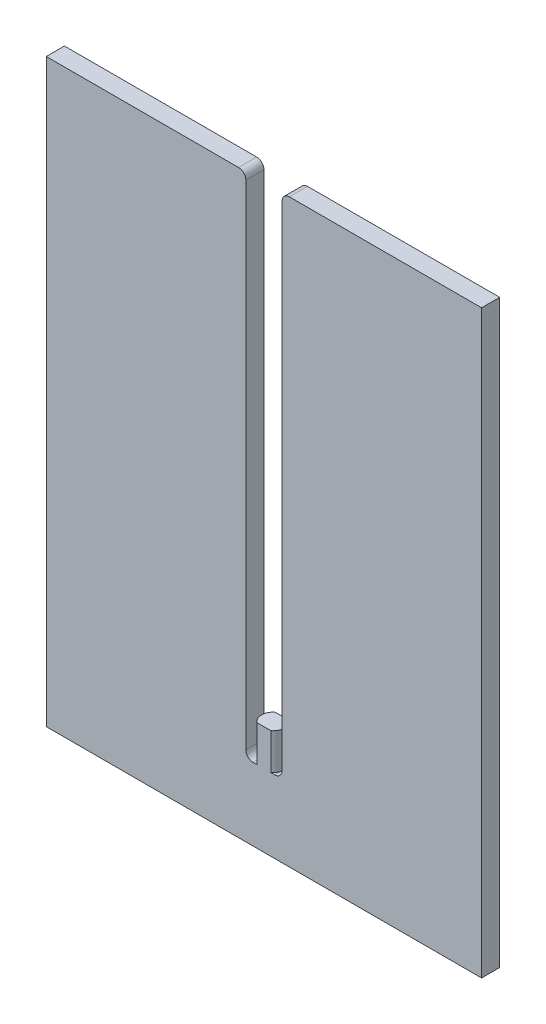
ISO-10303-21;
HEADER;
FILE_DESCRIPTION(('STEP AP214'),'2;1');
FILE_NAME('part.step','',(''),(''),'','','');
FILE_SCHEMA(('AUTOMOTIVE_DESIGN { 1 0 10303 214 1 1 1 1 }'));
ENDSEC;
DATA;
#1=APPLICATION_CONTEXT('core data for automotive mechanical design processes');
#2=APPLICATION_PROTOCOL_DEFINITION('international standard','automotive_design',2000,#1);
#3=PRODUCT_CONTEXT('',#1,'mechanical');
#4=PRODUCT('Part','Part','',(#3));
#5=PRODUCT_RELATED_PRODUCT_CATEGORY('part','',(#4));
#6=PRODUCT_DEFINITION_FORMATION('','',#4);
#7=PRODUCT_DEFINITION_CONTEXT('part definition',#1,'design');
#8=PRODUCT_DEFINITION('design','',#6,#7);
#9=PRODUCT_DEFINITION_SHAPE('','',#8);
#10=(LENGTH_UNIT() NAMED_UNIT(*) SI_UNIT(.MILLI.,.METRE.));
#11=(NAMED_UNIT(*) PLANE_ANGLE_UNIT() SI_UNIT($,.RADIAN.));
#12=(NAMED_UNIT(*) SI_UNIT($,.STERADIAN.) SOLID_ANGLE_UNIT());
#13=UNCERTAINTY_MEASURE_WITH_UNIT(LENGTH_MEASURE(1.E-05),#10,'distance_accuracy_value','');
#14=(GEOMETRIC_REPRESENTATION_CONTEXT(3) GLOBAL_UNCERTAINTY_ASSIGNED_CONTEXT((#13)) GLOBAL_UNIT_ASSIGNED_CONTEXT((#10,
#11,#12)) REPRESENTATION_CONTEXT('',''));
#15=CARTESIAN_POINT('',(0.,0.,0.));
#16=DIRECTION('',(0.,0.,1.));
#17=DIRECTION('',(1.,0.,0.));
#18=AXIS2_PLACEMENT_3D('',#15,#16,#17);
#19=CARTESIAN_POINT('',(-2.49999999999999,-30.,2.5));
#20=DIRECTION('',(0.,-1.,0.));
#21=DIRECTION('',(0.,0.,-1.));
#22=AXIS2_PLACEMENT_3D('',#19,#20,#21);
#23=PLANE('',#22);
#24=CARTESIAN_POINT('',(0.,-30.,1.25));
#25=DIRECTION('',(0.,1.,0.));
#26=DIRECTION('',(0.,0.,1.));
#27=AXIS2_PLACEMENT_3D('',#24,#25,#26);
#28=CIRCLE('',#27,1.5748);
#29=CARTESIAN_POINT('',(-0.957859613930977,-30.,0.));
#30=VERTEX_POINT('',#29);
#31=CARTESIAN_POINT('',(-1.49999999999999,-30.,0.77042201885405));
#32=VERTEX_POINT('',#31);
#33=EDGE_CURVE('E224',#30,#32,#28,.T.);
#34=ORIENTED_EDGE('',*,*,#33,.F.);
#35=DIRECTION('',(-1.,0.,0.));
#36=VECTOR('',#35,1.);
#37=CARTESIAN_POINT('',(-2.49999999999999,-30.,0.));
#38=LINE('',#37,#36);
#39=CARTESIAN_POINT('',(-1.49999999999999,-30.,0.));
#40=VERTEX_POINT('',#39);
#41=EDGE_CURVE('E252',#30,#40,#38,.T.);
#42=ORIENTED_EDGE('',*,*,#41,.T.);
#43=DIRECTION('',(0.,0.,-1.));
#44=VECTOR('',#43,1.);
#45=CARTESIAN_POINT('',(-1.49999999999999,-30.,2.5));
#46=LINE('',#45,#44);
#47=EDGE_CURVE('E374',#40,#32,#46,.F.);
#48=ORIENTED_EDGE('',*,*,#47,.T.);
#49=EDGE_LOOP('',(#34,#42,#48));
#50=FACE_BOUND('',#49,.T.);
#51=ADVANCED_FACE('F33',(#50),#23,.F.);
#52=CARTESIAN_POINT('',(-1.49999999999999,-30.,1.72957798114595));
#53=VERTEX_POINT('',#52);
#54=CARTESIAN_POINT('',(-0.957859613930977,-30.,2.5));
#55=VERTEX_POINT('',#54);
#56=EDGE_CURVE('E185',#53,#55,#28,.T.);
#57=ORIENTED_EDGE('',*,*,#56,.F.);
#58=CARTESIAN_POINT('',(-1.49999999999999,-30.,2.5));
#59=VERTEX_POINT('',#58);
#60=EDGE_CURVE('E37',#53,#59,#46,.F.);
#61=ORIENTED_EDGE('',*,*,#60,.T.);
#62=DIRECTION('',(-1.,0.,0.));
#63=VECTOR('',#62,1.);
#64=CARTESIAN_POINT('',(-2.49999999999999,-30.,2.5));
#65=LINE('',#64,#63);
#66=EDGE_CURVE('E50',#55,#59,#65,.T.);
#67=ORIENTED_EDGE('',*,*,#66,.F.);
#68=EDGE_LOOP('',(#57,#61,#67));
#69=FACE_BOUND('',#68,.T.);
#70=ADVANCED_FACE('F331',(#69),#23,.F.);
#71=CARTESIAN_POINT('',(0.,-30.,1.25));
#72=DIRECTION('',(0.,1.,0.));
#73=DIRECTION('',(0.,0.,1.));
#74=AXIS2_PLACEMENT_3D('',#71,#72,#73);
#75=CIRCLE('',#74,1.5748);
#76=CARTESIAN_POINT('',(0.957859613930977,-30.,2.5));
#77=VERTEX_POINT('',#76);
#78=CARTESIAN_POINT('',(1.49999999999999,-30.,1.72957798114595));
#79=VERTEX_POINT('',#78);
#80=EDGE_CURVE('E58',#77,#79,#75,.T.);
#81=ORIENTED_EDGE('',*,*,#80,.F.);
#82=CARTESIAN_POINT('',(1.49999999999999,-30.,2.5));
#83=VERTEX_POINT('',#82);
#84=EDGE_CURVE('E395',#83,#77,#65,.T.);
#85=ORIENTED_EDGE('',*,*,#84,.F.);
#86=DIRECTION('',(0.,0.,-1.));
#87=VECTOR('',#86,1.);
#88=CARTESIAN_POINT('',(1.49999999999999,-30.,0.));
#89=LINE('',#88,#87);
#90=EDGE_CURVE('E300',#83,#79,#89,.T.);
#91=ORIENTED_EDGE('',*,*,#90,.T.);
#92=EDGE_LOOP('',(#81,#85,#91));
#93=FACE_BOUND('',#92,.T.);
#94=ADVANCED_FACE('F337',(#93),#23,.F.);
#95=CARTESIAN_POINT('',(1.49999999999999,-30.,0.77042201885405));
#96=VERTEX_POINT('',#95);
#97=CARTESIAN_POINT('',(0.957859613930977,-30.,0.));
#98=VERTEX_POINT('',#97);
#99=EDGE_CURVE('E232',#96,#98,#75,.T.);
#100=ORIENTED_EDGE('',*,*,#99,.F.);
#101=CARTESIAN_POINT('',(1.49999999999999,-30.,0.));
#102=VERTEX_POINT('',#101);
#103=EDGE_CURVE('E292',#96,#102,#89,.T.);
#104=ORIENTED_EDGE('',*,*,#103,.T.);
#105=EDGE_CURVE('E249',#102,#98,#38,.T.);
#106=ORIENTED_EDGE('',*,*,#105,.T.);
#107=EDGE_LOOP('',(#100,#104,#106));
#108=FACE_BOUND('',#107,.T.);
#109=ADVANCED_FACE('F333',(#108),#23,.F.);
#110=CARTESIAN_POINT('',(-1.49999999999999,-29.,2.5));
#111=DIRECTION('',(0.,0.,1.));
#112=DIRECTION('',(1.,0.,0.));
#113=AXIS2_PLACEMENT_3D('',#110,#111,#112);
#114=CYLINDRICAL_SURFACE('',#113,1.);
#115=CARTESIAN_POINT('',(-1.49999999999999,-30.,0.770422018854051));
#116=CARTESIAN_POINT('',(-1.50823685902977,-30.000000801367,0.79618266378926));
#117=CARTESIAN_POINT('',(-1.51580883205124,-29.9999744613474,0.822155822113716));
#118=CARTESIAN_POINT('',(-1.52960575146465,-29.999869903012,0.874457487366343));
#119=CARTESIAN_POINT('',(-1.53583069289908,-29.9997916845052,0.900785995601939));
#120=CARTESIAN_POINT('',(-1.54691627444093,-29.9995857729442,0.953728686704265));
#121=CARTESIAN_POINT('',(-1.55177690450608,-29.9994580795257,0.980342871672275));
#122=CARTESIAN_POINT('',(-1.56012117086977,-29.9991411996913,1.0337862314104));
#123=CARTESIAN_POINT('',(-1.56360479196491,-29.9989520125964,1.06061540855089));
#124=CARTESIAN_POINT('',(-1.56918575178574,-29.998557817331,1.11441756391079));
#125=CARTESIAN_POINT('',(-1.57128307010401,-29.9983528089276,1.14139054424119));
#126=CARTESIAN_POINT('',(-1.57408585601794,-29.9977562993795,1.19540872479852));
#127=CARTESIAN_POINT('',(-1.57479129800291,-29.9973647948035,1.22245392634515));
#128=CARTESIAN_POINT('',(-1.57480485665639,-29.9971033924785,1.26498255657344));
#129=CARTESIAN_POINT('',(-1.57458140054261,-29.9970820589953,1.28046604249277));
#130=CARTESIAN_POINT('',(-1.5737766149523,-29.9971369409621,1.30804040607153));
#131=CARTESIAN_POINT('',(-1.57328406517811,-29.9971928767355,1.32013397327205));
#132=CARTESIAN_POINT('',(-1.57186848695075,-29.9973345325519,1.34721008661226));
#133=CARTESIAN_POINT('',(-1.57087047068141,-29.9974241795792,1.36218873907546));
#134=CARTESIAN_POINT('',(-1.5682118471368,-29.9976418852171,1.39500926877267));
#135=CARTESIAN_POINT('',(-1.5664603439362,-29.9977740205869,1.41284378691479));
#136=CARTESIAN_POINT('',(-1.56201616836717,-29.9980784166137,1.45133105892648));
#137=CARTESIAN_POINT('',(-1.55921689773168,-29.9982537091119,1.47197156080254));
#138=CARTESIAN_POINT('',(-1.55307075667954,-29.9985919767043,1.51140071606278));
#139=CARTESIAN_POINT('',(-1.54978942306827,-29.9987547531799,1.53019962310377));
#140=CARTESIAN_POINT('',(-1.54296609928996,-29.9990470204388,1.56549185849753));
#141=CARTESIAN_POINT('',(-1.53949854270536,-29.99917818185,1.58199958775812));
#142=CARTESIAN_POINT('',(-1.5325248606109,-29.9994101767196,1.61273580829415));
#143=CARTESIAN_POINT('',(-1.5290835602933,-29.9995127311363,1.62697901546408));
#144=CARTESIAN_POINT('',(-1.5223548301787,-29.9996880574066,1.65321891662184));
#145=CARTESIAN_POINT('',(-1.51912274006891,-29.9997629879359,1.66522982155018));
#146=CARTESIAN_POINT('',(-1.51080308886196,-29.9999173359696,1.69474879845921));
#147=CARTESIAN_POINT('',(-1.50555257782278,-29.999982582295,1.71221113872866));
#148=CARTESIAN_POINT('',(-1.49999999999999,-30.,1.72957798114595));
#149=B_SPLINE_CURVE_WITH_KNOTS('',3,(#115,#116,#117,#118,#119,#120,#121,#122,#123,#124,#125,
#126,#127,#128,#129,#130,#131,#132,#133,#134,#135,#136,#137,#138,#139,#140,#141,#142,#143,#144,
#145,#146,#147,#148),.UNSPECIFIED.,.F.,.F.,(4,2,2,2,2,2,2,2,2,2,2,2,2,2,2,2,4),(0.,
0.08112728018008,0.162254858930109,0.243383034818966,0.324512106408929,0.405642372252391,
0.486774130888562,0.533222616744404,0.569530666821631,0.614560848726554,0.668312937694743,
0.730786591586302,0.788025553382195,0.838622342845228,0.882576760548064,0.919888650283621,
0.974582452711007),.UNSPECIFIED.);
#150=EDGE_CURVE('E11',#32,#53,#149,.T.);
#151=ORIENTED_EDGE('',*,*,#150,.F.);
#152=ORIENTED_EDGE('',*,*,#47,.F.);
#153=CARTESIAN_POINT('',(-1.49999999999999,-29.,0.));
#154=DIRECTION('',(0.,0.,1.));
#155=DIRECTION('',(1.,0.,0.));
#156=AXIS2_PLACEMENT_3D('',#153,#154,#155);
#157=CIRCLE('',#156,1.);
#158=CARTESIAN_POINT('',(-2.49999999999999,-29.,0.));
#159=VERTEX_POINT('',#158);
#160=EDGE_CURVE('E254',#159,#40,#157,.T.);
#161=ORIENTED_EDGE('',*,*,#160,.F.);
#162=DIRECTION('',(0.,0.,-1.));
#163=VECTOR('',#162,1.);
#164=CARTESIAN_POINT('',(-2.49999999999999,-29.,0.));
#165=LINE('',#164,#163);
#166=CARTESIAN_POINT('',(-2.49999999999999,-29.,2.5));
#167=VERTEX_POINT('',#166);
#168=EDGE_CURVE('E289',#167,#159,#165,.T.);
#169=ORIENTED_EDGE('',*,*,#168,.F.);
#170=CARTESIAN_POINT('',(-1.49999999999999,-29.,2.5));
#171=DIRECTION('',(0.,0.,1.));
#172=DIRECTION('',(1.,0.,0.));
#173=AXIS2_PLACEMENT_3D('',#170,#171,#172);
#174=CIRCLE('',#173,1.);
#175=EDGE_CURVE('E354',#59,#167,#174,.F.);
#176=ORIENTED_EDGE('',*,*,#175,.F.);
#177=ORIENTED_EDGE('',*,*,#60,.F.);
#178=EDGE_LOOP('',(#151,#152,#161,#169,#176,#177));
#179=FACE_BOUND('',#178,.T.);
#180=ADVANCED_FACE('F317',(#179),#114,.F.);
#181=CARTESIAN_POINT('',(1.49999999999999,-29.,2.5));
#182=DIRECTION('',(0.,0.,1.));
#183=DIRECTION('',(1.,0.,0.));
#184=AXIS2_PLACEMENT_3D('',#181,#182,#183);
#185=CYLINDRICAL_SURFACE('',#184,1.);
#186=CARTESIAN_POINT('',(1.49999999999999,-30.,1.72957798114595));
#187=CARTESIAN_POINT('',(1.50823685902976,-30.000000801367,1.70381733621074));
#188=CARTESIAN_POINT('',(1.51580883205124,-29.9999744613474,1.67784417788629));
#189=CARTESIAN_POINT('',(1.52960575146465,-29.999869903012,1.62554251263366));
#190=CARTESIAN_POINT('',(1.53583069289908,-29.9997916845052,1.59921400439806));
#191=CARTESIAN_POINT('',(1.54691627444093,-29.9995857729442,1.54627131329574));
#192=CARTESIAN_POINT('',(1.55177690450608,-29.9994580795257,1.51965712832773));
#193=CARTESIAN_POINT('',(1.56012117086977,-29.9991411996913,1.4662137685896));
#194=CARTESIAN_POINT('',(1.56360479196491,-29.9989520125964,1.43938459144911));
#195=CARTESIAN_POINT('',(1.56918575178574,-29.998557817331,1.38558243608921));
#196=CARTESIAN_POINT('',(1.57128307010401,-29.9983528089276,1.35860945575881));
#197=CARTESIAN_POINT('',(1.57408585601794,-29.9977562993795,1.30459127520148));
#198=CARTESIAN_POINT('',(1.57479129800291,-29.9973647948035,1.27754607365485));
#199=CARTESIAN_POINT('',(1.57480485665639,-29.9971033924785,1.23501744342656));
#200=CARTESIAN_POINT('',(1.57458140054261,-29.9970820589953,1.21953395750723));
#201=CARTESIAN_POINT('',(1.5737766149523,-29.9971369409621,1.19195959392848));
#202=CARTESIAN_POINT('',(1.57328406517811,-29.9971928767355,1.17986602672795));
#203=CARTESIAN_POINT('',(1.57186848695075,-29.9973345325519,1.15278991338774));
#204=CARTESIAN_POINT('',(1.57087047068141,-29.9974241795792,1.13781126092454));
#205=CARTESIAN_POINT('',(1.56821184713681,-29.9976418852171,1.10499073122734));
#206=CARTESIAN_POINT('',(1.5664603439362,-29.9977740205869,1.08715621308521));
#207=CARTESIAN_POINT('',(1.56201616836717,-29.9980784166137,1.04866894107352));
#208=CARTESIAN_POINT('',(1.55921689773168,-29.9982537091119,1.02802843919746));
#209=CARTESIAN_POINT('',(1.55307075667954,-29.9985919767043,0.988599283937225));
#210=CARTESIAN_POINT('',(1.54978942306827,-29.9987547531799,0.969800376896231));
#211=CARTESIAN_POINT('',(1.54296609928996,-29.9990470204388,0.934508141502472));
#212=CARTESIAN_POINT('',(1.53949854270536,-29.99917818185,0.918000412241877));
#213=CARTESIAN_POINT('',(1.5325248606109,-29.9994101767196,0.887264191705854));
#214=CARTESIAN_POINT('',(1.5290835602933,-29.9995127311363,0.873020984535925));
#215=CARTESIAN_POINT('',(1.5223548301787,-29.9996880574066,0.846781083378161));
#216=CARTESIAN_POINT('',(1.51912274006891,-29.9997629879359,0.834770178449824));
#217=CARTESIAN_POINT('',(1.51080308886196,-29.9999173359696,0.805251201540786));
#218=CARTESIAN_POINT('',(1.50555257782278,-29.999982582295,0.787788861271335));
#219=CARTESIAN_POINT('',(1.49999999999999,-30.,0.770422018854049));
#220=B_SPLINE_CURVE_WITH_KNOTS('',3,(#186,#187,#188,#189,#190,#191,#192,#193,#194,#195,#196,
#197,#198,#199,#200,#201,#202,#203,#204,#205,#206,#207,#208,#209,#210,#211,#212,#213,#214,#215,
#216,#217,#218,#219),.UNSPECIFIED.,.F.,.F.,(4,2,2,2,2,2,2,2,2,2,2,2,2,2,2,2,4),(0.,
0.08112728018008,0.162254858930111,0.243383034818967,0.32451210640893,0.405642372252393,
0.486774130888564,0.533222616744406,0.569530666821633,0.614560848726554,0.668312937694744,
0.730786591586303,0.788025553382196,0.838622342845229,0.882576760548067,0.919888650283622,
0.974582452711011),.UNSPECIFIED.);
#221=EDGE_CURVE('E43',#79,#96,#220,.T.);
#222=ORIENTED_EDGE('',*,*,#221,.F.);
#223=ORIENTED_EDGE('',*,*,#90,.F.);
#224=CARTESIAN_POINT('',(1.49999999999999,-29.,2.5));
#225=DIRECTION('',(0.,0.,1.));
#226=DIRECTION('',(1.,0.,0.));
#227=AXIS2_PLACEMENT_3D('',#224,#225,#226);
#228=CIRCLE('',#227,1.);
#229=CARTESIAN_POINT('',(2.49999999999999,-29.,2.5));
#230=VERTEX_POINT('',#229);
#231=EDGE_CURVE('E353',#230,#83,#228,.F.);
#232=ORIENTED_EDGE('',*,*,#231,.F.);
#233=DIRECTION('',(0.,0.,-1.));
#234=VECTOR('',#233,1.);
#235=CARTESIAN_POINT('',(2.49999999999999,-29.,2.5));
#236=LINE('',#235,#234);
#237=CARTESIAN_POINT('',(2.49999999999999,-29.,0.));
#238=VERTEX_POINT('',#237);
#239=EDGE_CURVE('E351',#238,#230,#236,.F.);
#240=ORIENTED_EDGE('',*,*,#239,.F.);
#241=CARTESIAN_POINT('',(1.49999999999999,-29.,0.));
#242=DIRECTION('',(0.,0.,1.));
#243=DIRECTION('',(1.,0.,0.));
#244=AXIS2_PLACEMENT_3D('',#241,#242,#243);
#245=CIRCLE('',#244,1.);
#246=EDGE_CURVE('E349',#102,#238,#245,.T.);
#247=ORIENTED_EDGE('',*,*,#246,.F.);
#248=ORIENTED_EDGE('',*,*,#103,.F.);
#249=EDGE_LOOP('',(#222,#223,#232,#240,#247,#248));
#250=FACE_BOUND('',#249,.T.);
#251=ADVANCED_FACE('F307',(#250),#185,.F.);
#252=CARTESIAN_POINT('',(30.,40.,2.5));
#253=DIRECTION('',(-1.,0.,0.));
#254=DIRECTION('',(0.,-1.,0.));
#255=AXIS2_PLACEMENT_3D('',#252,#253,#254);
#256=PLANE('',#255);
#257=DIRECTION('',(0.,1.,0.));
#258=VECTOR('',#257,1.);
#259=CARTESIAN_POINT('',(30.,40.,0.));
#260=LINE('',#259,#258);
#261=CARTESIAN_POINT('',(30.,-40.,0.));
#262=VERTEX_POINT('',#261);
#263=CARTESIAN_POINT('',(30.,40.,0.));
#264=VERTEX_POINT('',#263);
#265=EDGE_CURVE('E186',#262,#264,#260,.T.);
#266=ORIENTED_EDGE('',*,*,#265,.T.);
#267=DIRECTION('',(0.,0.,-1.));
#268=VECTOR('',#267,1.);
#269=CARTESIAN_POINT('',(30.,40.,2.5));
#270=LINE('',#269,#268);
#271=CARTESIAN_POINT('',(30.,40.,2.5));
#272=VERTEX_POINT('',#271);
#273=EDGE_CURVE('E284',#272,#264,#270,.T.);
#274=ORIENTED_EDGE('',*,*,#273,.F.);
#275=DIRECTION('',(0.,1.,0.));
#276=VECTOR('',#275,1.);
#277=CARTESIAN_POINT('',(30.,40.,2.5));
#278=LINE('',#277,#276);
#279=CARTESIAN_POINT('',(30.,-40.,2.5));
#280=VERTEX_POINT('',#279);
#281=EDGE_CURVE('E273',#280,#272,#278,.T.);
#282=ORIENTED_EDGE('',*,*,#281,.F.);
#283=DIRECTION('',(0.,0.,-1.));
#284=VECTOR('',#283,1.);
#285=CARTESIAN_POINT('',(30.,-40.,2.5));
#286=LINE('',#285,#284);
#287=EDGE_CURVE('E274',#280,#262,#286,.T.);
#288=ORIENTED_EDGE('',*,*,#287,.T.);
#289=EDGE_LOOP('',(#266,#274,#282,#288));
#290=FACE_BOUND('',#289,.T.);
#291=ADVANCED_FACE('F316',(#290),#256,.F.);
#292=CARTESIAN_POINT('',(2.5,40.,2.5));
#293=DIRECTION('',(0.,-1.,0.));
#294=DIRECTION('',(0.,0.,-1.));
#295=AXIS2_PLACEMENT_3D('',#292,#293,#294);
#296=PLANE('',#295);
#297=DIRECTION('',(-1.,0.,0.));
#298=VECTOR('',#297,1.);
#299=CARTESIAN_POINT('',(2.5,40.,0.));
#300=LINE('',#299,#298);
#301=CARTESIAN_POINT('',(3.5,40.,0.));
#302=VERTEX_POINT('',#301);
#303=EDGE_CURVE('E189',#264,#302,#300,.T.);
#304=ORIENTED_EDGE('',*,*,#303,.T.);
#305=DIRECTION('',(0.,0.,-1.));
#306=VECTOR('',#305,1.);
#307=CARTESIAN_POINT('',(3.5,40.,2.5));
#308=LINE('',#307,#306);
#309=CARTESIAN_POINT('',(3.5,40.,2.5));
#310=VERTEX_POINT('',#309);
#311=EDGE_CURVE('E359',#302,#310,#308,.F.);
#312=ORIENTED_EDGE('',*,*,#311,.T.);
#313=DIRECTION('',(-1.,0.,0.));
#314=VECTOR('',#313,1.);
#315=CARTESIAN_POINT('',(2.5,40.,2.5));
#316=LINE('',#315,#314);
#317=EDGE_CURVE('E414',#272,#310,#316,.T.);
#318=ORIENTED_EDGE('',*,*,#317,.F.);
#319=ORIENTED_EDGE('',*,*,#273,.T.);
#320=EDGE_LOOP('',(#304,#312,#318,#319));
#321=FACE_BOUND('',#320,.T.);
#322=ADVANCED_FACE('F406',(#321),#296,.F.);
#323=CARTESIAN_POINT('',(2.5,40.,2.5));
#324=DIRECTION('',(1.,0.,0.));
#325=DIRECTION('',(0.,1.,0.));
#326=AXIS2_PLACEMENT_3D('',#323,#324,#325);
#327=PLANE('',#326);
#328=DIRECTION('',(0.,-1.,0.));
#329=VECTOR('',#328,1.);
#330=CARTESIAN_POINT('',(2.5,40.,0.));
#331=LINE('',#330,#329);
#332=CARTESIAN_POINT('',(2.5,39.,0.));
#333=VERTEX_POINT('',#332);
#334=EDGE_CURVE('E258',#333,#238,#331,.T.);
#335=ORIENTED_EDGE('',*,*,#334,.T.);
#336=ORIENTED_EDGE('',*,*,#239,.T.);
#337=DIRECTION('',(0.,-1.,0.));
#338=VECTOR('',#337,1.);
#339=CARTESIAN_POINT('',(2.5,40.,2.5));
#340=LINE('',#339,#338);
#341=CARTESIAN_POINT('',(2.5,39.,2.5));
#342=VERTEX_POINT('',#341);
#343=EDGE_CURVE('E412',#342,#230,#340,.T.);
#344=ORIENTED_EDGE('',*,*,#343,.F.);
#345=DIRECTION('',(0.,0.,-1.));
#346=VECTOR('',#345,1.);
#347=CARTESIAN_POINT('',(2.5,39.,2.5));
#348=LINE('',#347,#346);
#349=EDGE_CURVE('E372',#342,#333,#348,.T.);
#350=ORIENTED_EDGE('',*,*,#349,.T.);
#351=EDGE_LOOP('',(#335,#336,#344,#350));
#352=FACE_BOUND('',#351,.T.);
#353=ADVANCED_FACE('F415',(#352),#327,.F.);
#354=CARTESIAN_POINT('',(-2.5,40.,2.5));
#355=DIRECTION('',(-1.,0.,0.));
#356=DIRECTION('',(0.,-1.,0.));
#357=AXIS2_PLACEMENT_3D('',#354,#355,#356);
#358=PLANE('',#357);
#359=DIRECTION('',(0.,1.,0.));
#360=VECTOR('',#359,1.);
#361=CARTESIAN_POINT('',(-2.5,40.,2.5));
#362=LINE('',#361,#360);
#363=CARTESIAN_POINT('',(-2.5,39.,2.5));
#364=VERTEX_POINT('',#363);
#365=EDGE_CURVE('E390',#167,#364,#362,.T.);
#366=ORIENTED_EDGE('',*,*,#365,.F.);
#367=ORIENTED_EDGE('',*,*,#168,.T.);
#368=DIRECTION('',(0.,1.,0.));
#369=VECTOR('',#368,1.);
#370=CARTESIAN_POINT('',(-2.5,40.,0.));
#371=LINE('',#370,#369);
#372=CARTESIAN_POINT('',(-2.5,39.,0.));
#373=VERTEX_POINT('',#372);
#374=EDGE_CURVE('E260',#159,#373,#371,.T.);
#375=ORIENTED_EDGE('',*,*,#374,.T.);
#376=DIRECTION('',(0.,0.,-1.));
#377=VECTOR('',#376,1.);
#378=CARTESIAN_POINT('',(-2.5,39.,2.5));
#379=LINE('',#378,#377);
#380=EDGE_CURVE('E287',#373,#364,#379,.F.);
#381=ORIENTED_EDGE('',*,*,#380,.T.);
#382=EDGE_LOOP('',(#366,#367,#375,#381));
#383=FACE_BOUND('',#382,.T.);
#384=ADVANCED_FACE('F392',(#383),#358,.F.);
#385=CARTESIAN_POINT('',(-30.,40.,2.5));
#386=DIRECTION('',(0.,-1.,0.));
#387=DIRECTION('',(0.,0.,-1.));
#388=AXIS2_PLACEMENT_3D('',#385,#386,#387);
#389=PLANE('',#388);
#390=DIRECTION('',(-1.,0.,0.));
#391=VECTOR('',#390,1.);
#392=CARTESIAN_POINT('',(-30.,40.,2.5));
#393=LINE('',#392,#391);
#394=CARTESIAN_POINT('',(-3.5,40.,2.5));
#395=VERTEX_POINT('',#394);
#396=CARTESIAN_POINT('',(-30.,40.,2.5));
#397=VERTEX_POINT('',#396);
#398=EDGE_CURVE('E394',#395,#397,#393,.T.);
#399=ORIENTED_EDGE('',*,*,#398,.F.);
#400=DIRECTION('',(0.,0.,-1.));
#401=VECTOR('',#400,1.);
#402=CARTESIAN_POINT('',(-3.5,40.,2.5));
#403=LINE('',#402,#401);
#404=CARTESIAN_POINT('',(-3.5,40.,0.));
#405=VERTEX_POINT('',#404);
#406=EDGE_CURVE('E369',#395,#405,#403,.T.);
#407=ORIENTED_EDGE('',*,*,#406,.T.);
#408=DIRECTION('',(-1.,0.,0.));
#409=VECTOR('',#408,1.);
#410=CARTESIAN_POINT('',(-30.,40.,0.));
#411=LINE('',#410,#409);
#412=CARTESIAN_POINT('',(-30.,40.,0.));
#413=VERTEX_POINT('',#412);
#414=EDGE_CURVE('E267',#405,#413,#411,.T.);
#415=ORIENTED_EDGE('',*,*,#414,.T.);
#416=DIRECTION('',(0.,0.,-1.));
#417=VECTOR('',#416,1.);
#418=CARTESIAN_POINT('',(-30.,40.,2.5));
#419=LINE('',#418,#417);
#420=EDGE_CURVE('E281',#397,#413,#419,.T.);
#421=ORIENTED_EDGE('',*,*,#420,.F.);
#422=EDGE_LOOP('',(#399,#407,#415,#421));
#423=FACE_BOUND('',#422,.T.);
#424=ADVANCED_FACE('F432',(#423),#389,.F.);
#425=CARTESIAN_POINT('',(-30.,40.,2.5));
#426=DIRECTION('',(1.,0.,0.));
#427=DIRECTION('',(0.,1.,0.));
#428=AXIS2_PLACEMENT_3D('',#425,#426,#427);
#429=PLANE('',#428);
#430=DIRECTION('',(0.,-1.,0.));
#431=VECTOR('',#430,1.);
#432=CARTESIAN_POINT('',(-30.,40.,0.));
#433=LINE('',#432,#431);
#434=CARTESIAN_POINT('',(-30.,-40.,0.));
#435=VERTEX_POINT('',#434);
#436=EDGE_CURVE('E269',#413,#435,#433,.T.);
#437=ORIENTED_EDGE('',*,*,#436,.T.);
#438=DIRECTION('',(0.,0.,-1.));
#439=VECTOR('',#438,1.);
#440=CARTESIAN_POINT('',(-30.,-40.,2.5));
#441=LINE('',#440,#439);
#442=CARTESIAN_POINT('',(-30.,-40.,2.5));
#443=VERTEX_POINT('',#442);
#444=EDGE_CURVE('E277',#443,#435,#441,.T.);
#445=ORIENTED_EDGE('',*,*,#444,.F.);
#446=DIRECTION('',(0.,-1.,0.));
#447=VECTOR('',#446,1.);
#448=CARTESIAN_POINT('',(-30.,40.,2.5));
#449=LINE('',#448,#447);
#450=EDGE_CURVE('E397',#397,#443,#449,.T.);
#451=ORIENTED_EDGE('',*,*,#450,.F.);
#452=ORIENTED_EDGE('',*,*,#420,.T.);
#453=EDGE_LOOP('',(#437,#445,#451,#452));
#454=FACE_BOUND('',#453,.T.);
#455=ADVANCED_FACE('F428',(#454),#429,.F.);
#456=CARTESIAN_POINT('',(-30.,-40.,2.5));
#457=DIRECTION('',(0.,1.,0.));
#458=DIRECTION('',(0.,0.,1.));
#459=AXIS2_PLACEMENT_3D('',#456,#457,#458);
#460=PLANE('',#459);
#461=DIRECTION('',(1.,0.,0.));
#462=VECTOR('',#461,1.);
#463=CARTESIAN_POINT('',(-30.,-40.,0.));
#464=LINE('',#463,#462);
#465=EDGE_CURVE('E271',#435,#262,#464,.T.);
#466=ORIENTED_EDGE('',*,*,#465,.T.);
#467=ORIENTED_EDGE('',*,*,#287,.F.);
#468=DIRECTION('',(1.,0.,0.));
#469=VECTOR('',#468,1.);
#470=CARTESIAN_POINT('',(-30.,-40.,2.5));
#471=LINE('',#470,#469);
#472=EDGE_CURVE('E278',#443,#280,#471,.T.);
#473=ORIENTED_EDGE('',*,*,#472,.F.);
#474=ORIENTED_EDGE('',*,*,#444,.T.);
#475=EDGE_LOOP('',(#466,#467,#473,#474));
#476=FACE_BOUND('',#475,.T.);
#477=ADVANCED_FACE('F424',(#476),#460,.F.);
#478=CARTESIAN_POINT('',(0.,0.,2.5));
#479=DIRECTION('',(0.,0.,1.));
#480=DIRECTION('',(1.,0.,0.));
#481=AXIS2_PLACEMENT_3D('',#478,#479,#480);
#482=PLANE('',#481);
#483=ORIENTED_EDGE('',*,*,#365,.T.);
#484=CARTESIAN_POINT('',(-3.5,39.,2.5));
#485=DIRECTION('',(0.,0.,1.));
#486=DIRECTION('',(1.,0.,0.));
#487=AXIS2_PLACEMENT_3D('',#484,#485,#486);
#488=CIRCLE('',#487,1.);
#489=EDGE_CURVE('E361',#364,#395,#488,.T.);
#490=ORIENTED_EDGE('',*,*,#489,.T.);
#491=ORIENTED_EDGE('',*,*,#398,.T.);
#492=ORIENTED_EDGE('',*,*,#450,.T.);
#493=ORIENTED_EDGE('',*,*,#472,.T.);
#494=ORIENTED_EDGE('',*,*,#281,.T.);
#495=ORIENTED_EDGE('',*,*,#317,.T.);
#496=CARTESIAN_POINT('',(3.5,39.,2.5));
#497=DIRECTION('',(0.,0.,1.));
#498=DIRECTION('',(1.,0.,0.));
#499=AXIS2_PLACEMENT_3D('',#496,#497,#498);
#500=CIRCLE('',#499,1.);
#501=EDGE_CURVE('E363',#310,#342,#500,.T.);
#502=ORIENTED_EDGE('',*,*,#501,.T.);
#503=ORIENTED_EDGE('',*,*,#343,.T.);
#504=ORIENTED_EDGE('',*,*,#231,.T.);
#505=ORIENTED_EDGE('',*,*,#84,.T.);
#506=DIRECTION('',(0.,-1.,0.));
#507=VECTOR('',#506,1.);
#508=CARTESIAN_POINT('',(0.957859613930977,-25.,2.5));
#509=LINE('',#508,#507);
#510=CARTESIAN_POINT('',(0.957859613930977,-25.,2.5));
#511=VERTEX_POINT('',#510);
#512=EDGE_CURVE('E169',#511,#77,#509,.T.);
#513=ORIENTED_EDGE('',*,*,#512,.F.);
#514=DIRECTION('',(1.,0.,0.));
#515=VECTOR('',#514,1.);
#516=CARTESIAN_POINT('',(0.957859613930977,-25.,2.5));
#517=LINE('',#516,#515);
#518=CARTESIAN_POINT('',(-0.957859613930977,-25.,2.5));
#519=VERTEX_POINT('',#518);
#520=EDGE_CURVE('E162',#519,#511,#517,.T.);
#521=ORIENTED_EDGE('',*,*,#520,.F.);
#522=DIRECTION('',(0.,-1.,0.));
#523=VECTOR('',#522,1.);
#524=CARTESIAN_POINT('',(-0.957859613930977,-25.,2.5));
#525=LINE('',#524,#523);
#526=EDGE_CURVE('E167',#519,#55,#525,.T.);
#527=ORIENTED_EDGE('',*,*,#526,.T.);
#528=ORIENTED_EDGE('',*,*,#66,.T.);
#529=ORIENTED_EDGE('',*,*,#175,.T.);
#530=EDGE_LOOP('',(#483,#490,#491,#492,#493,#494,#495,#502,#503,#504,#505,#513,#521,#527,#528,#529));
#531=FACE_BOUND('',#530,.T.);
#532=ADVANCED_FACE('F165',(#531),#482,.T.);
#533=CARTESIAN_POINT('',(0.,0.,0.));
#534=DIRECTION('',(0.,0.,1.));
#535=DIRECTION('',(1.,0.,0.));
#536=AXIS2_PLACEMENT_3D('',#533,#534,#535);
#537=PLANE('',#536);
#538=ORIENTED_EDGE('',*,*,#414,.F.);
#539=CARTESIAN_POINT('',(-3.5,39.,0.));
#540=DIRECTION('',(0.,0.,1.));
#541=DIRECTION('',(1.,0.,0.));
#542=AXIS2_PLACEMENT_3D('',#539,#540,#541);
#543=CIRCLE('',#542,1.);
#544=EDGE_CURVE('E365',#405,#373,#543,.F.);
#545=ORIENTED_EDGE('',*,*,#544,.T.);
#546=ORIENTED_EDGE('',*,*,#374,.F.);
#547=ORIENTED_EDGE('',*,*,#160,.T.);
#548=ORIENTED_EDGE('',*,*,#41,.F.);
#549=DIRECTION('',(0.,-1.,0.));
#550=VECTOR('',#549,1.);
#551=CARTESIAN_POINT('',(-0.957859613930977,-25.,0.));
#552=LINE('',#551,#550);
#553=CARTESIAN_POINT('',(-0.957859613930977,-25.,0.));
#554=VERTEX_POINT('',#553);
#555=EDGE_CURVE('E240',#554,#30,#552,.T.);
#556=ORIENTED_EDGE('',*,*,#555,.F.);
#557=DIRECTION('',(-1.,0.,0.));
#558=VECTOR('',#557,1.);
#559=CARTESIAN_POINT('',(-0.957859613930977,-25.,0.));
#560=LINE('',#559,#558);
#561=CARTESIAN_POINT('',(0.957859613930977,-25.,0.));
#562=VERTEX_POINT('',#561);
#563=EDGE_CURVE('E178',#562,#554,#560,.T.);
#564=ORIENTED_EDGE('',*,*,#563,.F.);
#565=DIRECTION('',(0.,-1.,0.));
#566=VECTOR('',#565,1.);
#567=CARTESIAN_POINT('',(0.957859613930977,-25.,0.));
#568=LINE('',#567,#566);
#569=EDGE_CURVE('E191',#562,#98,#568,.T.);
#570=ORIENTED_EDGE('',*,*,#569,.T.);
#571=ORIENTED_EDGE('',*,*,#105,.F.);
#572=ORIENTED_EDGE('',*,*,#246,.T.);
#573=ORIENTED_EDGE('',*,*,#334,.F.);
#574=CARTESIAN_POINT('',(3.5,39.,0.));
#575=DIRECTION('',(0.,0.,1.));
#576=DIRECTION('',(1.,0.,0.));
#577=AXIS2_PLACEMENT_3D('',#574,#575,#576);
#578=CIRCLE('',#577,1.);
#579=EDGE_CURVE('E367',#333,#302,#578,.F.);
#580=ORIENTED_EDGE('',*,*,#579,.T.);
#581=ORIENTED_EDGE('',*,*,#303,.F.);
#582=ORIENTED_EDGE('',*,*,#265,.F.);
#583=ORIENTED_EDGE('',*,*,#465,.F.);
#584=ORIENTED_EDGE('',*,*,#436,.F.);
#585=EDGE_LOOP('',(#538,#545,#546,#547,#548,#556,#564,#570,#571,#572,#573,#580,#581,#582,#583,#584));
#586=FACE_BOUND('',#585,.T.);
#587=ADVANCED_FACE('F248',(#586),#537,.F.);
#588=CARTESIAN_POINT('',(-3.5,39.,2.5));
#589=DIRECTION('',(0.,0.,-1.));
#590=DIRECTION('',(-1.,0.,0.));
#591=AXIS2_PLACEMENT_3D('',#588,#589,#590);
#592=CYLINDRICAL_SURFACE('',#591,1.);
#593=ORIENTED_EDGE('',*,*,#489,.F.);
#594=ORIENTED_EDGE('',*,*,#380,.F.);
#595=ORIENTED_EDGE('',*,*,#544,.F.);
#596=ORIENTED_EDGE('',*,*,#406,.F.);
#597=EDGE_LOOP('',(#593,#594,#595,#596));
#598=FACE_BOUND('',#597,.T.);
#599=ADVANCED_FACE('F321',(#598),#592,.T.);
#600=CARTESIAN_POINT('',(3.5,39.,2.5));
#601=DIRECTION('',(0.,0.,-1.));
#602=DIRECTION('',(-1.,0.,0.));
#603=AXIS2_PLACEMENT_3D('',#600,#601,#602);
#604=CYLINDRICAL_SURFACE('',#603,1.);
#605=ORIENTED_EDGE('',*,*,#501,.F.);
#606=ORIENTED_EDGE('',*,*,#311,.F.);
#607=ORIENTED_EDGE('',*,*,#579,.F.);
#608=ORIENTED_EDGE('',*,*,#349,.F.);
#609=EDGE_LOOP('',(#605,#606,#607,#608));
#610=FACE_BOUND('',#609,.T.);
#611=ADVANCED_FACE('F35',(#610),#604,.T.);
#612=CARTESIAN_POINT('',(0.,-25.,1.25));
#613=DIRECTION('',(0.,-1.,0.));
#614=DIRECTION('',(0.,0.,-1.));
#615=AXIS2_PLACEMENT_3D('',#612,#613,#614);
#616=CYLINDRICAL_SURFACE('',#615,1.5748);
#617=ORIENTED_EDGE('',*,*,#33,.T.);
#618=ORIENTED_EDGE('',*,*,#150,.T.);
#619=ORIENTED_EDGE('',*,*,#56,.T.);
#620=ORIENTED_EDGE('',*,*,#526,.F.);
#621=CARTESIAN_POINT('',(0.,-25.,1.25));
#622=DIRECTION('',(0.,1.,0.));
#623=DIRECTION('',(0.,0.,1.));
#624=AXIS2_PLACEMENT_3D('',#621,#622,#623);
#625=CIRCLE('',#624,1.5748);
#626=EDGE_CURVE('E173',#554,#519,#625,.T.);
#627=ORIENTED_EDGE('',*,*,#626,.F.);
#628=ORIENTED_EDGE('',*,*,#555,.T.);
#629=EDGE_LOOP('',(#617,#618,#619,#620,#627,#628));
#630=FACE_BOUND('',#629,.T.);
#631=ADVANCED_FACE('F184',(#630),#616,.T.);
#632=CARTESIAN_POINT('',(0.,-25.,1.25));
#633=DIRECTION('',(0.,-1.,0.));
#634=DIRECTION('',(0.,0.,-1.));
#635=AXIS2_PLACEMENT_3D('',#632,#633,#634);
#636=CYLINDRICAL_SURFACE('',#635,1.5748);
#637=ORIENTED_EDGE('',*,*,#80,.T.);
#638=ORIENTED_EDGE('',*,*,#221,.T.);
#639=ORIENTED_EDGE('',*,*,#99,.T.);
#640=ORIENTED_EDGE('',*,*,#569,.F.);
#641=CARTESIAN_POINT('',(0.,-25.,1.25));
#642=DIRECTION('',(0.,1.,0.));
#643=DIRECTION('',(0.,0.,1.));
#644=AXIS2_PLACEMENT_3D('',#641,#642,#643);
#645=CIRCLE('',#644,1.5748);
#646=EDGE_CURVE('E172',#511,#562,#645,.T.);
#647=ORIENTED_EDGE('',*,*,#646,.F.);
#648=ORIENTED_EDGE('',*,*,#512,.T.);
#649=EDGE_LOOP('',(#637,#638,#639,#640,#647,#648));
#650=FACE_BOUND('',#649,.T.);
#651=ADVANCED_FACE('F205',(#650),#636,.T.);
#652=CARTESIAN_POINT('',(0.,-25.,1.25));
#653=DIRECTION('',(0.,1.,0.));
#654=DIRECTION('',(0.,0.,1.));
#655=AXIS2_PLACEMENT_3D('',#652,#653,#654);
#656=PLANE('',#655);
#657=ORIENTED_EDGE('',*,*,#626,.T.);
#658=ORIENTED_EDGE('',*,*,#520,.T.);
#659=ORIENTED_EDGE('',*,*,#646,.T.);
#660=ORIENTED_EDGE('',*,*,#563,.T.);
#661=EDGE_LOOP('',(#657,#658,#659,#660));
#662=FACE_BOUND('',#661,.T.);
#663=ADVANCED_FACE('F176',(#662),#656,.T.);
#664=CLOSED_SHELL('',(#51,#70,#94,#109,#180,#251,#291,#322,#353,#384,#424,#455,#477,#532,#587,
#599,#611,#631,#651,#663));
#665=MANIFOLD_SOLID_BREP('B2',#664);
#666=ADVANCED_BREP_SHAPE_REPRESENTATION('',(#18,#665),#14);
#667=SHAPE_DEFINITION_REPRESENTATION(#9,#666);
ENDSEC;
END-ISO-10303-21;
